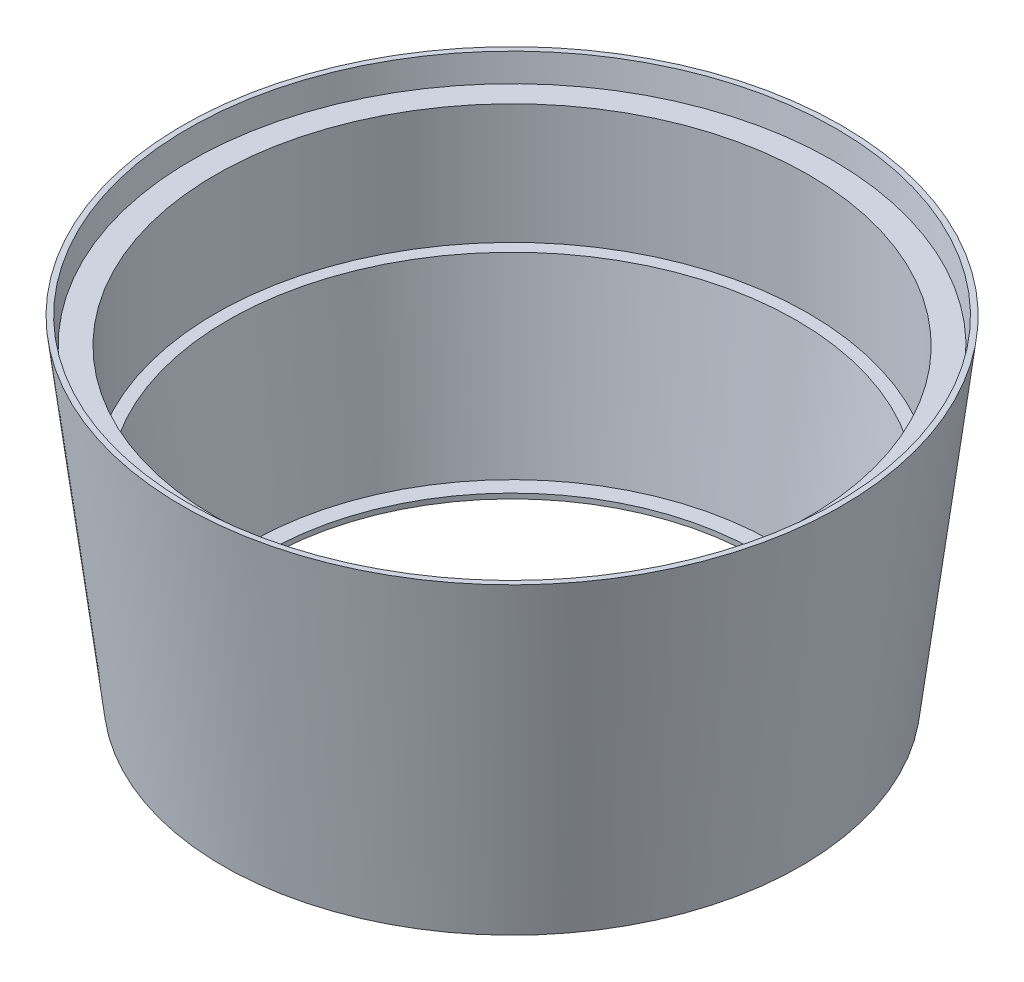
ISO-10303-21;
HEADER;
FILE_DESCRIPTION(('STEP AP214'),'2;1');
FILE_NAME('part.step','',(''),(''),'','','');
FILE_SCHEMA(('AUTOMOTIVE_DESIGN { 1 0 10303 214 1 1 1 1 }'));
ENDSEC;
DATA;
#1=APPLICATION_CONTEXT('core data for automotive mechanical design processes');
#2=APPLICATION_PROTOCOL_DEFINITION('international standard','automotive_design',2000,#1);
#3=PRODUCT_CONTEXT('',#1,'mechanical');
#4=PRODUCT('Part','Part','',(#3));
#5=PRODUCT_RELATED_PRODUCT_CATEGORY('part','',(#4));
#6=PRODUCT_DEFINITION_FORMATION('','',#4);
#7=PRODUCT_DEFINITION_CONTEXT('part definition',#1,'design');
#8=PRODUCT_DEFINITION('design','',#6,#7);
#9=PRODUCT_DEFINITION_SHAPE('','',#8);
#10=(LENGTH_UNIT() NAMED_UNIT(*) SI_UNIT(.MILLI.,.METRE.));
#11=(NAMED_UNIT(*) PLANE_ANGLE_UNIT() SI_UNIT($,.RADIAN.));
#12=(NAMED_UNIT(*) SI_UNIT($,.STERADIAN.) SOLID_ANGLE_UNIT());
#13=UNCERTAINTY_MEASURE_WITH_UNIT(LENGTH_MEASURE(1.E-05),#10,'distance_accuracy_value','');
#14=(GEOMETRIC_REPRESENTATION_CONTEXT(3) GLOBAL_UNCERTAINTY_ASSIGNED_CONTEXT((#13)) GLOBAL_UNIT_ASSIGNED_CONTEXT((#10,
#11,#12)) REPRESENTATION_CONTEXT('',''));
#15=CARTESIAN_POINT('',(0.,0.,0.));
#16=DIRECTION('',(0.,0.,1.));
#17=DIRECTION('',(1.,0.,0.));
#18=AXIS2_PLACEMENT_3D('',#15,#16,#17);
#19=CARTESIAN_POINT('',(-752.,0.,0.));
#20=DIRECTION('',(0.,-1.,0.));
#21=DIRECTION('',(0.,0.,-1.));
#22=AXIS2_PLACEMENT_3D('',#19,#20,#21);
#23=CYLINDRICAL_SURFACE('',#22,682.183398148017);
#24=CARTESIAN_POINT('',(-752.,0.,0.));
#25=DIRECTION('',(0.,-1.,0.));
#26=DIRECTION('',(0.,0.,-1.));
#27=AXIS2_PLACEMENT_3D('',#24,#25,#26);
#28=CIRCLE('',#27,682.183398148017);
#29=CARTESIAN_POINT('',(-752.,0.,-682.183398148017));
#30=VERTEX_POINT('',#29);
#31=EDGE_CURVE('E67',#30,#30,#28,.T.);
#32=ORIENTED_EDGE('',*,*,#31,.T.);
#33=EDGE_LOOP('',(#32));
#34=FACE_BOUND('',#33,.T.);
#35=CARTESIAN_POINT('',(-752.,14.,0.));
#36=DIRECTION('',(0.,-1.,0.));
#37=DIRECTION('',(0.,0.,-1.));
#38=AXIS2_PLACEMENT_3D('',#35,#36,#37);
#39=CIRCLE('',#38,682.183398148017);
#40=CARTESIAN_POINT('',(-752.,14.,-682.183398148017));
#41=VERTEX_POINT('',#40);
#42=EDGE_CURVE('E10',#41,#41,#39,.T.);
#43=ORIENTED_EDGE('',*,*,#42,.F.);
#44=EDGE_LOOP('',(#43));
#45=FACE_BOUND('',#44,.T.);
#46=ADVANCED_FACE('F33',(#34,#45),#23,.F.);
#47=CARTESIAN_POINT('',(-69.8166018519828,14.,0.));
#48=DIRECTION('',(0.,1.,0.));
#49=DIRECTION('',(0.,0.,1.));
#50=AXIS2_PLACEMENT_3D('',#47,#48,#49);
#51=PLANE('',#50);
#52=ORIENTED_EDGE('',*,*,#42,.T.);
#53=EDGE_LOOP('',(#52));
#54=FACE_BOUND('',#53,.T.);
#55=CARTESIAN_POINT('',(-752.,14.,0.));
#56=DIRECTION('',(0.,-1.,0.));
#57=DIRECTION('',(0.,0.,-1.));
#58=AXIS2_PLACEMENT_3D('',#55,#56,#57);
#59=CIRCLE('',#58,727.903067494511);
#60=CARTESIAN_POINT('',(-752.,14.,-727.903067494511));
#61=VERTEX_POINT('',#60);
#62=EDGE_CURVE('E39',#61,#61,#59,.T.);
#63=ORIENTED_EDGE('',*,*,#62,.F.);
#64=EDGE_LOOP('',(#63));
#65=FACE_BOUND('',#64,.T.);
#66=ADVANCED_FACE('F85',(#54,#65),#51,.T.);
#67=CARTESIAN_POINT('',(-752.,517.31114797937,0.));
#68=DIRECTION('',(0.,1.,0.));
#69=DIRECTION('',(0.,0.,1.));
#70=AXIS2_PLACEMENT_3D('',#67,#68,#69);
#71=CONICAL_SURFACE('',#70,789.701905796693,0.1221730476396);
#72=ORIENTED_EDGE('',*,*,#62,.T.);
#73=EDGE_LOOP('',(#72));
#74=FACE_BOUND('',#73,.T.);
#75=CARTESIAN_POINT('',(-752.,517.31114797937,0.));
#76=DIRECTION('',(0.,-1.,0.));
#77=DIRECTION('',(0.,0.,-1.));
#78=AXIS2_PLACEMENT_3D('',#75,#76,#77);
#79=CIRCLE('',#78,789.701905796693);
#80=CARTESIAN_POINT('',(-752.,517.31114797937,-789.701905796693));
#81=VERTEX_POINT('',#80);
#82=EDGE_CURVE('E43',#81,#81,#79,.T.);
#83=ORIENTED_EDGE('',*,*,#82,.F.);
#84=EDGE_LOOP('',(#83));
#85=FACE_BOUND('',#84,.T.);
#86=ADVANCED_FACE('F89',(#74,#85),#71,.F.);
#87=CARTESIAN_POINT('',(71.1231062868478,517.31114797937,0.));
#88=DIRECTION('',(0.,1.,0.));
#89=DIRECTION('',(0.,0.,1.));
#90=AXIS2_PLACEMENT_3D('',#87,#88,#89);
#91=PLANE('',#90);
#92=ORIENTED_EDGE('',*,*,#82,.T.);
#93=EDGE_LOOP('',(#92));
#94=FACE_BOUND('',#93,.T.);
#95=CARTESIAN_POINT('',(-752.,517.31114797937,0.));
#96=DIRECTION('',(0.,-1.,0.));
#97=DIRECTION('',(0.,0.,-1.));
#98=AXIS2_PLACEMENT_3D('',#95,#96,#97);
#99=CIRCLE('',#98,823.123106286848);
#100=CARTESIAN_POINT('',(-752.,517.31114797937,-823.123106286848));
#101=VERTEX_POINT('',#100);
#102=EDGE_CURVE('E47',#101,#101,#99,.T.);
#103=ORIENTED_EDGE('',*,*,#102,.F.);
#104=EDGE_LOOP('',(#103));
#105=FACE_BOUND('',#104,.T.);
#106=ADVANCED_FACE('F93',(#94,#105),#91,.T.);
#107=CARTESIAN_POINT('',(-752.,0.,0.));
#108=DIRECTION('',(0.,-1.,0.));
#109=DIRECTION('',(0.,0.,-1.));
#110=AXIS2_PLACEMENT_3D('',#107,#108,#109);
#111=CYLINDRICAL_SURFACE('',#110,823.123106286848);
#112=ORIENTED_EDGE('',*,*,#102,.T.);
#113=EDGE_LOOP('',(#112));
#114=FACE_BOUND('',#113,.T.);
#115=CARTESIAN_POINT('',(-752.,850.65651163265,0.));
#116=DIRECTION('',(0.,-1.,0.));
#117=DIRECTION('',(0.,0.,-1.));
#118=AXIS2_PLACEMENT_3D('',#115,#116,#117);
#119=CIRCLE('',#118,823.123106286848);
#120=CARTESIAN_POINT('',(-752.,850.65651163265,-823.123106286848));
#121=VERTEX_POINT('',#120);
#122=EDGE_CURVE('E52',#121,#121,#119,.T.);
#123=ORIENTED_EDGE('',*,*,#122,.F.);
#124=EDGE_LOOP('',(#123));
#125=FACE_BOUND('',#124,.T.);
#126=ADVANCED_FACE('F99',(#114,#125),#111,.F.);
#127=CARTESIAN_POINT('',(139.447486260008,850.65651163265,0.));
#128=DIRECTION('',(0.,1.,0.));
#129=DIRECTION('',(0.,0.,1.));
#130=AXIS2_PLACEMENT_3D('',#127,#128,#129);
#131=PLANE('',#130);
#132=ORIENTED_EDGE('',*,*,#122,.T.);
#133=EDGE_LOOP('',(#132));
#134=FACE_BOUND('',#133,.T.);
#135=CARTESIAN_POINT('',(-752.,850.65651163265,0.));
#136=DIRECTION('',(0.,-1.,0.));
#137=DIRECTION('',(0.,0.,-1.));
#138=AXIS2_PLACEMENT_3D('',#135,#136,#137);
#139=CIRCLE('',#138,891.447486260008);
#140=CARTESIAN_POINT('',(-752.,850.65651163265,-891.447486260008));
#141=VERTEX_POINT('',#140);
#142=EDGE_CURVE('E55',#141,#141,#139,.T.);
#143=ORIENTED_EDGE('',*,*,#142,.F.);
#144=EDGE_LOOP('',(#143));
#145=FACE_BOUND('',#144,.T.);
#146=ADVANCED_FACE('F103',(#134,#145),#131,.T.);
#147=CARTESIAN_POINT('',(-752.,922.824399012114,0.));
#148=DIRECTION('',(0.,1.,0.));
#149=DIRECTION('',(0.,0.,1.));
#150=AXIS2_PLACEMENT_3D('',#147,#148,#149);
#151=CONICAL_SURFACE('',#150,900.308588623186,0.122173047639599);
#152=ORIENTED_EDGE('',*,*,#142,.T.);
#153=EDGE_LOOP('',(#152));
#154=FACE_BOUND('',#153,.T.);
#155=CARTESIAN_POINT('',(-752.,922.824399012114,0.));
#156=DIRECTION('',(0.,-1.,0.));
#157=DIRECTION('',(0.,0.,-1.));
#158=AXIS2_PLACEMENT_3D('',#155,#156,#157);
#159=CIRCLE('',#158,900.308588623186);
#160=CARTESIAN_POINT('',(-752.,922.824399012114,-900.308588623186));
#161=VERTEX_POINT('',#160);
#162=EDGE_CURVE('E58',#161,#161,#159,.T.);
#163=ORIENTED_EDGE('',*,*,#162,.F.);
#164=EDGE_LOOP('',(#163));
#165=FACE_BOUND('',#164,.T.);
#166=ADVANCED_FACE('F107',(#154,#165),#151,.F.);
#167=CARTESIAN_POINT('',(163.308588623186,922.824399012114,0.));
#168=DIRECTION('',(0.,1.,0.));
#169=DIRECTION('',(0.,0.,1.));
#170=AXIS2_PLACEMENT_3D('',#167,#168,#169);
#171=PLANE('',#170);
#172=ORIENTED_EDGE('',*,*,#162,.T.);
#173=EDGE_LOOP('',(#172));
#174=FACE_BOUND('',#173,.T.);
#175=CARTESIAN_POINT('',(-752.,922.824399012114,0.));
#176=DIRECTION('',(0.,-1.,0.));
#177=DIRECTION('',(0.,0.,-1.));
#178=AXIS2_PLACEMENT_3D('',#175,#176,#177);
#179=CIRCLE('',#178,915.308588623186);
#180=CARTESIAN_POINT('',(-752.,922.824399012114,-915.308588623186));
#181=VERTEX_POINT('',#180);
#182=EDGE_CURVE('E61',#181,#181,#179,.T.);
#183=ORIENTED_EDGE('',*,*,#182,.F.);
#184=EDGE_LOOP('',(#183));
#185=FACE_BOUND('',#184,.T.);
#186=ADVANCED_FACE('F81',(#174,#185),#171,.T.);
#187=CARTESIAN_POINT('',(-752.,0.,0.));
#188=DIRECTION('',(0.,1.,0.));
#189=DIRECTION('',(0.,0.,1.));
#190=AXIS2_PLACEMENT_3D('',#187,#188,#189);
#191=CONICAL_SURFACE('',#190,802.,0.1221730476396);
#192=ORIENTED_EDGE('',*,*,#182,.T.);
#193=EDGE_LOOP('',(#192));
#194=FACE_BOUND('',#193,.T.);
#195=CARTESIAN_POINT('',(-752.,0.,0.));
#196=DIRECTION('',(0.,-1.,0.));
#197=DIRECTION('',(0.,0.,-1.));
#198=AXIS2_PLACEMENT_3D('',#195,#196,#197);
#199=CIRCLE('',#198,802.);
#200=CARTESIAN_POINT('',(-752.,0.,-802.));
#201=VERTEX_POINT('',#200);
#202=EDGE_CURVE('E64',#201,#201,#199,.T.);
#203=ORIENTED_EDGE('',*,*,#202,.F.);
#204=EDGE_LOOP('',(#203));
#205=FACE_BOUND('',#204,.T.);
#206=ADVANCED_FACE('F75',(#194,#205),#191,.T.);
#207=CARTESIAN_POINT('',(-69.8166018519828,0.,0.));
#208=DIRECTION('',(0.,-1.,0.));
#209=DIRECTION('',(0.,0.,-1.));
#210=AXIS2_PLACEMENT_3D('',#207,#208,#209);
#211=PLANE('',#210);
#212=ORIENTED_EDGE('',*,*,#202,.T.);
#213=EDGE_LOOP('',(#212));
#214=FACE_BOUND('',#213,.T.);
#215=ORIENTED_EDGE('',*,*,#31,.F.);
#216=EDGE_LOOP('',(#215));
#217=FACE_BOUND('',#216,.T.);
#218=ADVANCED_FACE('F73',(#214,#217),#211,.T.);
#219=CLOSED_SHELL('',(#46,#66,#86,#106,#126,#146,#166,#186,#206,#218));
#220=MANIFOLD_SOLID_BREP('B2',#219);
#221=ADVANCED_BREP_SHAPE_REPRESENTATION('',(#18,#220),#14);
#222=SHAPE_DEFINITION_REPRESENTATION(#9,#221);
ENDSEC;
END-ISO-10303-21;
